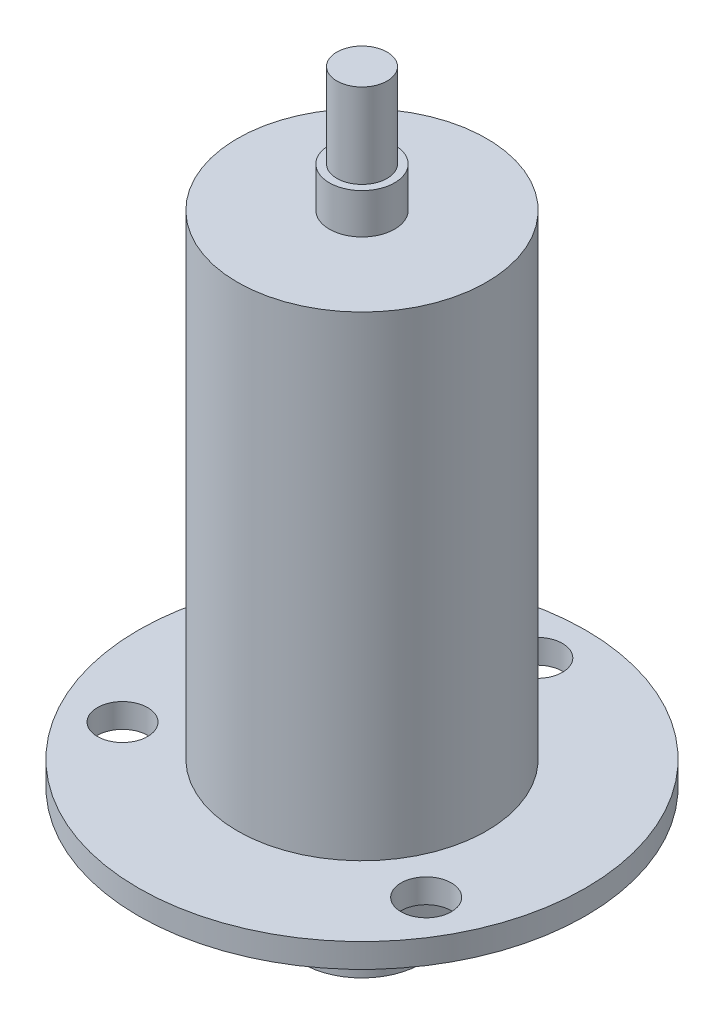
ISO-10303-21;
HEADER;
FILE_DESCRIPTION(('STEP AP214'),'2;1');
FILE_NAME('part.step','',(''),(''),'','','');
FILE_SCHEMA(('AUTOMOTIVE_DESIGN { 1 0 10303 214 1 1 1 1 }'));
ENDSEC;
DATA;
#1=APPLICATION_CONTEXT('core data for automotive mechanical design processes');
#2=APPLICATION_PROTOCOL_DEFINITION('international standard','automotive_design',2000,#1);
#3=PRODUCT_CONTEXT('',#1,'mechanical');
#4=PRODUCT('Part','Part','',(#3));
#5=PRODUCT_RELATED_PRODUCT_CATEGORY('part','',(#4));
#6=PRODUCT_DEFINITION_FORMATION('','',#4);
#7=PRODUCT_DEFINITION_CONTEXT('part definition',#1,'design');
#8=PRODUCT_DEFINITION('design','',#6,#7);
#9=PRODUCT_DEFINITION_SHAPE('','',#8);
#10=(LENGTH_UNIT() NAMED_UNIT(*) SI_UNIT(.MILLI.,.METRE.));
#11=(NAMED_UNIT(*) PLANE_ANGLE_UNIT() SI_UNIT($,.RADIAN.));
#12=(NAMED_UNIT(*) SI_UNIT($,.STERADIAN.) SOLID_ANGLE_UNIT());
#13=UNCERTAINTY_MEASURE_WITH_UNIT(LENGTH_MEASURE(1.E-05),#10,'distance_accuracy_value','');
#14=(GEOMETRIC_REPRESENTATION_CONTEXT(3) GLOBAL_UNCERTAINTY_ASSIGNED_CONTEXT((#13)) GLOBAL_UNIT_ASSIGNED_CONTEXT((#10,
#11,#12)) REPRESENTATION_CONTEXT('',''));
#15=CARTESIAN_POINT('',(0.,0.,0.));
#16=DIRECTION('',(0.,0.,1.));
#17=DIRECTION('',(1.,0.,0.));
#18=AXIS2_PLACEMENT_3D('',#15,#16,#17);
#19=CARTESIAN_POINT('',(0.,2.4,0.));
#20=DIRECTION('',(0.,1.,0.));
#21=DIRECTION('',(0.,0.,1.));
#22=AXIS2_PLACEMENT_3D('',#19,#20,#21);
#23=PLANE('',#22);
#24=CARTESIAN_POINT('',(0.,2.4,0.));
#25=DIRECTION('',(0.,1.,0.));
#26=DIRECTION('',(0.,0.,1.));
#27=AXIS2_PLACEMENT_3D('',#24,#25,#26);
#28=CIRCLE('',#27,12.4);
#29=CARTESIAN_POINT('',(0.,2.4,12.4));
#30=VERTEX_POINT('',#29);
#31=EDGE_CURVE('E65',#30,#30,#28,.T.);
#32=ORIENTED_EDGE('',*,*,#31,.F.);
#33=EDGE_LOOP('',(#32));
#34=FACE_BOUND('',#33,.T.);
#35=CARTESIAN_POINT('',(15.1121432960396,2.4,8.72499999999936));
#36=DIRECTION('',(0.,1.,0.));
#37=DIRECTION('',(0.,0.,1.));
#38=AXIS2_PLACEMENT_3D('',#35,#36,#37);
#39=CIRCLE('',#38,2.50000000000096);
#40=CARTESIAN_POINT('',(15.1121432960396,2.4,11.2250000000003));
#41=VERTEX_POINT('',#40);
#42=EDGE_CURVE('E78',#41,#41,#39,.T.);
#43=ORIENTED_EDGE('',*,*,#42,.F.);
#44=EDGE_LOOP('',(#43));
#45=FACE_BOUND('',#44,.T.);
#46=CARTESIAN_POINT('',(0.,2.4,0.));
#47=DIRECTION('',(0.,1.,0.));
#48=DIRECTION('',(0.,0.,1.));
#49=AXIS2_PLACEMENT_3D('',#46,#47,#48);
#50=CIRCLE('',#49,22.25);
#51=CARTESIAN_POINT('',(0.,2.4,22.25));
#52=VERTEX_POINT('',#51);
#53=EDGE_CURVE('E71',#52,#52,#50,.T.);
#54=ORIENTED_EDGE('',*,*,#53,.T.);
#55=EDGE_LOOP('',(#54));
#56=FACE_BOUND('',#55,.T.);
#57=CARTESIAN_POINT('',(0.,2.4,-17.45));
#58=DIRECTION('',(0.,1.,0.));
#59=DIRECTION('',(0.,0.,1.));
#60=AXIS2_PLACEMENT_3D('',#57,#58,#59);
#61=CIRCLE('',#60,2.5);
#62=CARTESIAN_POINT('',(0.,2.4,-14.95));
#63=VERTEX_POINT('',#62);
#64=EDGE_CURVE('E84',#63,#63,#61,.T.);
#65=ORIENTED_EDGE('',*,*,#64,.F.);
#66=EDGE_LOOP('',(#65));
#67=FACE_BOUND('',#66,.T.);
#68=CARTESIAN_POINT('',(-15.1121432960373,2.4,8.72500000000065));
#69=DIRECTION('',(0.,1.,0.));
#70=DIRECTION('',(0.,0.,1.));
#71=AXIS2_PLACEMENT_3D('',#68,#69,#70);
#72=CIRCLE('',#71,2.50000000000141);
#73=CARTESIAN_POINT('',(-15.1121432960373,2.4,11.2250000000021));
#74=VERTEX_POINT('',#73);
#75=EDGE_CURVE('E72',#74,#74,#72,.T.);
#76=ORIENTED_EDGE('',*,*,#75,.F.);
#77=EDGE_LOOP('',(#76));
#78=FACE_BOUND('',#77,.T.);
#79=ADVANCED_FACE('F32',(#34,#45,#56,#67,#78),#23,.T.);
#80=CARTESIAN_POINT('',(0.,0.,0.));
#81=DIRECTION('',(0.,1.,0.));
#82=DIRECTION('',(0.,0.,1.));
#83=AXIS2_PLACEMENT_3D('',#80,#81,#82);
#84=PLANE('',#83);
#85=CARTESIAN_POINT('',(0.,0.,0.));
#86=DIRECTION('',(0.,-1.,0.));
#87=DIRECTION('',(0.,0.,-1.));
#88=AXIS2_PLACEMENT_3D('',#85,#86,#87);
#89=CIRCLE('',#88,12.385);
#90=CARTESIAN_POINT('',(0.,0.,-12.385));
#91=VERTEX_POINT('',#90);
#92=EDGE_CURVE('E40',#91,#91,#89,.T.);
#93=ORIENTED_EDGE('',*,*,#92,.F.);
#94=EDGE_LOOP('',(#93));
#95=FACE_BOUND('',#94,.T.);
#96=CARTESIAN_POINT('',(0.,0.,0.));
#97=DIRECTION('',(0.,1.,0.));
#98=DIRECTION('',(0.,0.,1.));
#99=AXIS2_PLACEMENT_3D('',#96,#97,#98);
#100=CIRCLE('',#99,22.25);
#101=CARTESIAN_POINT('',(0.,0.,22.25));
#102=VERTEX_POINT('',#101);
#103=EDGE_CURVE('E36',#102,#102,#100,.T.);
#104=ORIENTED_EDGE('',*,*,#103,.F.);
#105=EDGE_LOOP('',(#104));
#106=FACE_BOUND('',#105,.T.);
#107=CARTESIAN_POINT('',(0.,0.,-17.45));
#108=DIRECTION('',(0.,1.,0.));
#109=DIRECTION('',(0.,0.,1.));
#110=AXIS2_PLACEMENT_3D('',#107,#108,#109);
#111=CIRCLE('',#110,2.5);
#112=CARTESIAN_POINT('',(0.,0.,-14.95));
#113=VERTEX_POINT('',#112);
#114=EDGE_CURVE('E81',#113,#113,#111,.T.);
#115=ORIENTED_EDGE('',*,*,#114,.T.);
#116=EDGE_LOOP('',(#115));
#117=FACE_BOUND('',#116,.T.);
#118=CARTESIAN_POINT('',(15.1121432960396,0.,8.72499999999936));
#119=DIRECTION('',(0.,1.,0.));
#120=DIRECTION('',(0.,0.,1.));
#121=AXIS2_PLACEMENT_3D('',#118,#119,#120);
#122=CIRCLE('',#121,2.50000000000096);
#123=CARTESIAN_POINT('',(15.1121432960396,0.,11.2250000000003));
#124=VERTEX_POINT('',#123);
#125=EDGE_CURVE('E75',#124,#124,#122,.T.);
#126=ORIENTED_EDGE('',*,*,#125,.T.);
#127=EDGE_LOOP('',(#126));
#128=FACE_BOUND('',#127,.T.);
#129=CARTESIAN_POINT('',(-15.1121432960373,0.,8.72500000000065));
#130=DIRECTION('',(0.,1.,0.));
#131=DIRECTION('',(0.,0.,1.));
#132=AXIS2_PLACEMENT_3D('',#129,#130,#131);
#133=CIRCLE('',#132,2.50000000000141);
#134=CARTESIAN_POINT('',(-15.1121432960373,0.,11.2250000000021));
#135=VERTEX_POINT('',#134);
#136=EDGE_CURVE('E68',#135,#135,#133,.T.);
#137=ORIENTED_EDGE('',*,*,#136,.T.);
#138=EDGE_LOOP('',(#137));
#139=FACE_BOUND('',#138,.T.);
#140=ADVANCED_FACE('F95',(#95,#106,#117,#128,#139),#84,.F.);
#141=CARTESIAN_POINT('',(0.,2.4,0.));
#142=DIRECTION('',(0.,-1.,0.));
#143=DIRECTION('',(0.,0.,-1.));
#144=AXIS2_PLACEMENT_3D('',#141,#142,#143);
#145=CYLINDRICAL_SURFACE('',#144,22.25);
#146=ORIENTED_EDGE('',*,*,#53,.F.);
#147=EDGE_LOOP('',(#146));
#148=FACE_BOUND('',#147,.T.);
#149=ORIENTED_EDGE('',*,*,#103,.T.);
#150=EDGE_LOOP('',(#149));
#151=FACE_BOUND('',#150,.T.);
#152=ADVANCED_FACE('F34',(#148,#151),#145,.T.);
#153=CARTESIAN_POINT('',(0.,2.4,-17.45));
#154=DIRECTION('',(0.,-1.,0.));
#155=DIRECTION('',(0.,0.,-1.));
#156=AXIS2_PLACEMENT_3D('',#153,#154,#155);
#157=CYLINDRICAL_SURFACE('',#156,2.5);
#158=ORIENTED_EDGE('',*,*,#64,.T.);
#159=EDGE_LOOP('',(#158));
#160=FACE_BOUND('',#159,.T.);
#161=ORIENTED_EDGE('',*,*,#114,.F.);
#162=EDGE_LOOP('',(#161));
#163=FACE_BOUND('',#162,.T.);
#164=ADVANCED_FACE('F118',(#160,#163),#157,.F.);
#165=CARTESIAN_POINT('',(15.1121432960396,2.4,8.72499999999936));
#166=DIRECTION('',(0.,-1.,0.));
#167=DIRECTION('',(0.,0.,-1.));
#168=AXIS2_PLACEMENT_3D('',#165,#166,#167);
#169=CYLINDRICAL_SURFACE('',#168,2.50000000000096);
#170=ORIENTED_EDGE('',*,*,#42,.T.);
#171=EDGE_LOOP('',(#170));
#172=FACE_BOUND('',#171,.T.);
#173=ORIENTED_EDGE('',*,*,#125,.F.);
#174=EDGE_LOOP('',(#173));
#175=FACE_BOUND('',#174,.T.);
#176=ADVANCED_FACE('F108',(#172,#175),#169,.F.);
#177=CARTESIAN_POINT('',(-15.1121432960373,2.4,8.72500000000065));
#178=DIRECTION('',(0.,-1.,0.));
#179=DIRECTION('',(0.,0.,-1.));
#180=AXIS2_PLACEMENT_3D('',#177,#178,#179);
#181=CYLINDRICAL_SURFACE('',#180,2.50000000000141);
#182=ORIENTED_EDGE('',*,*,#75,.T.);
#183=EDGE_LOOP('',(#182));
#184=FACE_BOUND('',#183,.T.);
#185=ORIENTED_EDGE('',*,*,#136,.F.);
#186=EDGE_LOOP('',(#185));
#187=FACE_BOUND('',#186,.T.);
#188=ADVANCED_FACE('F105',(#184,#187),#181,.F.);
#189=CARTESIAN_POINT('',(0.,49.7,0.));
#190=DIRECTION('',(0.,-1.,0.));
#191=DIRECTION('',(0.,0.,-1.));
#192=AXIS2_PLACEMENT_3D('',#189,#190,#191);
#193=CYLINDRICAL_SURFACE('',#192,12.4);
#194=CARTESIAN_POINT('',(0.,49.7,0.));
#195=DIRECTION('',(0.,1.,0.));
#196=DIRECTION('',(0.,0.,1.));
#197=AXIS2_PLACEMENT_3D('',#194,#195,#196);
#198=CIRCLE('',#197,12.4);
#199=CARTESIAN_POINT('',(0.,49.7,12.4));
#200=VERTEX_POINT('',#199);
#201=EDGE_CURVE('E62',#200,#200,#198,.T.);
#202=ORIENTED_EDGE('',*,*,#201,.F.);
#203=EDGE_LOOP('',(#202));
#204=FACE_BOUND('',#203,.T.);
#205=ORIENTED_EDGE('',*,*,#31,.T.);
#206=EDGE_LOOP('',(#205));
#207=FACE_BOUND('',#206,.T.);
#208=ADVANCED_FACE('F107',(#204,#207),#193,.T.);
#209=CARTESIAN_POINT('',(0.,49.7,0.));
#210=DIRECTION('',(0.,1.,0.));
#211=DIRECTION('',(0.,0.,1.));
#212=AXIS2_PLACEMENT_3D('',#209,#210,#211);
#213=PLANE('',#212);
#214=CARTESIAN_POINT('',(0.,49.7,0.));
#215=DIRECTION('',(0.,1.,0.));
#216=DIRECTION('',(0.,0.,1.));
#217=AXIS2_PLACEMENT_3D('',#214,#215,#216);
#218=CIRCLE('',#217,3.25);
#219=CARTESIAN_POINT('',(0.,49.7,3.25));
#220=VERTEX_POINT('',#219);
#221=EDGE_CURVE('E59',#220,#220,#218,.T.);
#222=ORIENTED_EDGE('',*,*,#221,.F.);
#223=EDGE_LOOP('',(#222));
#224=FACE_BOUND('',#223,.T.);
#225=ORIENTED_EDGE('',*,*,#201,.T.);
#226=EDGE_LOOP('',(#225));
#227=FACE_BOUND('',#226,.T.);
#228=ADVANCED_FACE('F115',(#224,#227),#213,.T.);
#229=CARTESIAN_POINT('',(0.,53.7,0.));
#230=DIRECTION('',(0.,-1.,0.));
#231=DIRECTION('',(0.,0.,-1.));
#232=AXIS2_PLACEMENT_3D('',#229,#230,#231);
#233=CYLINDRICAL_SURFACE('',#232,3.25);
#234=CARTESIAN_POINT('',(0.,53.7,0.));
#235=DIRECTION('',(0.,1.,0.));
#236=DIRECTION('',(0.,0.,1.));
#237=AXIS2_PLACEMENT_3D('',#234,#235,#236);
#238=CIRCLE('',#237,3.25);
#239=CARTESIAN_POINT('',(0.,53.7,3.25));
#240=VERTEX_POINT('',#239);
#241=EDGE_CURVE('E56',#240,#240,#238,.T.);
#242=ORIENTED_EDGE('',*,*,#241,.F.);
#243=EDGE_LOOP('',(#242));
#244=FACE_BOUND('',#243,.T.);
#245=ORIENTED_EDGE('',*,*,#221,.T.);
#246=EDGE_LOOP('',(#245));
#247=FACE_BOUND('',#246,.T.);
#248=ADVANCED_FACE('F208',(#244,#247),#233,.T.);
#249=CARTESIAN_POINT('',(0.,53.7,0.));
#250=DIRECTION('',(0.,1.,0.));
#251=DIRECTION('',(0.,0.,1.));
#252=AXIS2_PLACEMENT_3D('',#249,#250,#251);
#253=PLANE('',#252);
#254=CARTESIAN_POINT('',(0.,53.7,0.));
#255=DIRECTION('',(0.,1.,0.));
#256=DIRECTION('',(0.,0.,1.));
#257=AXIS2_PLACEMENT_3D('',#254,#255,#256);
#258=CIRCLE('',#257,2.5);
#259=CARTESIAN_POINT('',(0.,53.7,2.5));
#260=VERTEX_POINT('',#259);
#261=EDGE_CURVE('E45',#260,#260,#258,.T.);
#262=ORIENTED_EDGE('',*,*,#261,.F.);
#263=EDGE_LOOP('',(#262));
#264=FACE_BOUND('',#263,.T.);
#265=ORIENTED_EDGE('',*,*,#241,.T.);
#266=EDGE_LOOP('',(#265));
#267=FACE_BOUND('',#266,.T.);
#268=ADVANCED_FACE('F204',(#264,#267),#253,.T.);
#269=CARTESIAN_POINT('',(0.,62.1,0.));
#270=DIRECTION('',(0.,-1.,0.));
#271=DIRECTION('',(0.,0.,-1.));
#272=AXIS2_PLACEMENT_3D('',#269,#270,#271);
#273=CYLINDRICAL_SURFACE('',#272,2.5);
#274=CARTESIAN_POINT('',(0.,62.1,0.));
#275=DIRECTION('',(0.,1.,0.));
#276=DIRECTION('',(0.,0.,1.));
#277=AXIS2_PLACEMENT_3D('',#274,#275,#276);
#278=CIRCLE('',#277,2.5);
#279=CARTESIAN_POINT('',(0.,62.1,2.5));
#280=VERTEX_POINT('',#279);
#281=EDGE_CURVE('E52',#280,#280,#278,.T.);
#282=ORIENTED_EDGE('',*,*,#281,.F.);
#283=EDGE_LOOP('',(#282));
#284=FACE_BOUND('',#283,.T.);
#285=ORIENTED_EDGE('',*,*,#261,.T.);
#286=EDGE_LOOP('',(#285));
#287=FACE_BOUND('',#286,.T.);
#288=ADVANCED_FACE('F200',(#284,#287),#273,.T.);
#289=CARTESIAN_POINT('',(0.,62.1,0.));
#290=DIRECTION('',(0.,1.,0.));
#291=DIRECTION('',(0.,0.,1.));
#292=AXIS2_PLACEMENT_3D('',#289,#290,#291);
#293=PLANE('',#292);
#294=ORIENTED_EDGE('',*,*,#281,.T.);
#295=EDGE_LOOP('',(#294));
#296=FACE_BOUND('',#295,.T.);
#297=ADVANCED_FACE('F153',(#296),#293,.T.);
#298=CARTESIAN_POINT('',(0.,-5.1,0.));
#299=DIRECTION('',(0.,1.,0.));
#300=DIRECTION('',(0.,0.,1.));
#301=AXIS2_PLACEMENT_3D('',#298,#299,#300);
#302=CYLINDRICAL_SURFACE('',#301,12.385);
#303=CARTESIAN_POINT('',(0.,-5.1,0.));
#304=DIRECTION('',(0.,-1.,0.));
#305=DIRECTION('',(0.,0.,-1.));
#306=AXIS2_PLACEMENT_3D('',#303,#304,#305);
#307=CIRCLE('',#306,12.385);
#308=CARTESIAN_POINT('',(0.,-5.1,-12.385));
#309=VERTEX_POINT('',#308);
#310=EDGE_CURVE('E50',#309,#309,#307,.T.);
#311=ORIENTED_EDGE('',*,*,#310,.F.);
#312=EDGE_LOOP('',(#311));
#313=FACE_BOUND('',#312,.T.);
#314=ORIENTED_EDGE('',*,*,#92,.T.);
#315=EDGE_LOOP('',(#314));
#316=FACE_BOUND('',#315,.T.);
#317=ADVANCED_FACE('F158',(#313,#316),#302,.T.);
#318=CARTESIAN_POINT('',(0.,-5.1,0.));
#319=DIRECTION('',(0.,-1.,0.));
#320=DIRECTION('',(0.,0.,-1.));
#321=AXIS2_PLACEMENT_3D('',#318,#319,#320);
#322=PLANE('',#321);
#323=CARTESIAN_POINT('',(0.,-5.1,0.));
#324=DIRECTION('',(0.,-1.,0.));
#325=DIRECTION('',(0.,0.,-1.));
#326=AXIS2_PLACEMENT_3D('',#323,#324,#325);
#327=CIRCLE('',#326,5.9);
#328=CARTESIAN_POINT('',(0.,-5.1,-5.9));
#329=VERTEX_POINT('',#328);
#330=EDGE_CURVE('E10',#329,#329,#327,.T.);
#331=ORIENTED_EDGE('',*,*,#330,.F.);
#332=EDGE_LOOP('',(#331));
#333=FACE_BOUND('',#332,.T.);
#334=ORIENTED_EDGE('',*,*,#310,.T.);
#335=EDGE_LOOP('',(#334));
#336=FACE_BOUND('',#335,.T.);
#337=ADVANCED_FACE('F163',(#333,#336),#322,.T.);
#338=CARTESIAN_POINT('',(0.,-12.3,0.));
#339=DIRECTION('',(0.,1.,0.));
#340=DIRECTION('',(0.,0.,1.));
#341=AXIS2_PLACEMENT_3D('',#338,#339,#340);
#342=CYLINDRICAL_SURFACE('',#341,5.9);
#343=CARTESIAN_POINT('',(0.,-12.3,0.));
#344=DIRECTION('',(0.,-1.,0.));
#345=DIRECTION('',(0.,0.,-1.));
#346=AXIS2_PLACEMENT_3D('',#343,#344,#345);
#347=CIRCLE('',#346,5.9);
#348=CARTESIAN_POINT('',(0.,-12.3,-5.9));
#349=VERTEX_POINT('',#348);
#350=EDGE_CURVE('E49',#349,#349,#347,.T.);
#351=ORIENTED_EDGE('',*,*,#350,.F.);
#352=EDGE_LOOP('',(#351));
#353=FACE_BOUND('',#352,.T.);
#354=ORIENTED_EDGE('',*,*,#330,.T.);
#355=EDGE_LOOP('',(#354));
#356=FACE_BOUND('',#355,.T.);
#357=ADVANCED_FACE('F173',(#353,#356),#342,.T.);
#358=CARTESIAN_POINT('',(0.,-12.3,0.));
#359=DIRECTION('',(0.,-1.,0.));
#360=DIRECTION('',(0.,0.,-1.));
#361=AXIS2_PLACEMENT_3D('',#358,#359,#360);
#362=PLANE('',#361);
#363=ORIENTED_EDGE('',*,*,#350,.T.);
#364=EDGE_LOOP('',(#363));
#365=FACE_BOUND('',#364,.T.);
#366=ADVANCED_FACE('F183',(#365),#362,.T.);
#367=CLOSED_SHELL('',(#79,#140,#152,#164,#176,#188,#208,#228,#248,#268,#288,#297,#317,#337,#357,#366));
#368=MANIFOLD_SOLID_BREP('B2',#367);
#369=ADVANCED_BREP_SHAPE_REPRESENTATION('',(#18,#368),#14);
#370=SHAPE_DEFINITION_REPRESENTATION(#9,#369);
ENDSEC;
END-ISO-10303-21;
